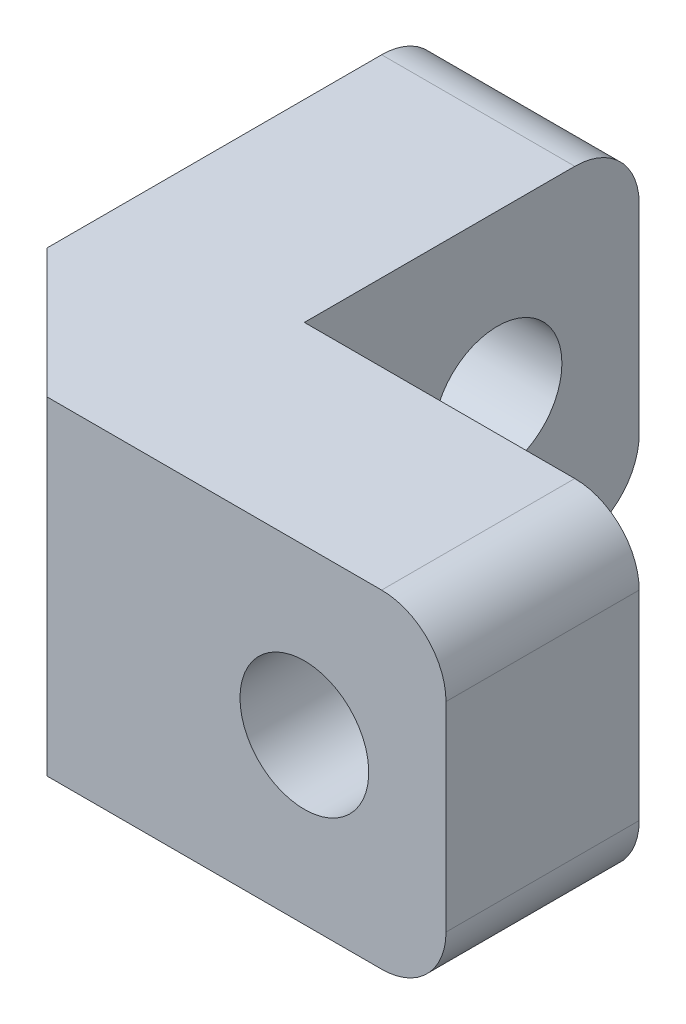
ISO-10303-21;
HEADER;
FILE_DESCRIPTION(('STEP AP214'),'2;1');
FILE_NAME('part.step','',(''),(''),'','','');
FILE_SCHEMA(('AUTOMOTIVE_DESIGN { 1 0 10303 214 1 1 1 1 }'));
ENDSEC;
DATA;
#1=APPLICATION_CONTEXT('core data for automotive mechanical design processes');
#2=APPLICATION_PROTOCOL_DEFINITION('international standard','automotive_design',2000,#1);
#3=PRODUCT_CONTEXT('',#1,'mechanical');
#4=PRODUCT('Part','Part','',(#3));
#5=PRODUCT_RELATED_PRODUCT_CATEGORY('part','',(#4));
#6=PRODUCT_DEFINITION_FORMATION('','',#4);
#7=PRODUCT_DEFINITION_CONTEXT('part definition',#1,'design');
#8=PRODUCT_DEFINITION('design','',#6,#7);
#9=PRODUCT_DEFINITION_SHAPE('','',#8);
#10=(LENGTH_UNIT() NAMED_UNIT(*) SI_UNIT(.MILLI.,.METRE.));
#11=(NAMED_UNIT(*) PLANE_ANGLE_UNIT() SI_UNIT($,.RADIAN.));
#12=(NAMED_UNIT(*) SI_UNIT($,.STERADIAN.) SOLID_ANGLE_UNIT());
#13=UNCERTAINTY_MEASURE_WITH_UNIT(LENGTH_MEASURE(1.E-05),#10,'distance_accuracy_value','');
#14=(GEOMETRIC_REPRESENTATION_CONTEXT(3) GLOBAL_UNCERTAINTY_ASSIGNED_CONTEXT((#13)) GLOBAL_UNIT_ASSIGNED_CONTEXT((#10,
#11,#12)) REPRESENTATION_CONTEXT('',''));
#15=CARTESIAN_POINT('',(0.,0.,0.));
#16=DIRECTION('',(0.,0.,1.));
#17=DIRECTION('',(1.,0.,0.));
#18=AXIS2_PLACEMENT_3D('',#15,#16,#17);
#19=CARTESIAN_POINT('',(-5.1,2.55,-3.));
#20=DIRECTION('',(1.,0.,0.));
#21=DIRECTION('',(0.,0.,-1.));
#22=AXIS2_PLACEMENT_3D('',#19,#20,#21);
#23=CYLINDRICAL_SURFACE('',#22,1.);
#24=CARTESIAN_POINT('',(0.,2.55,-3.));
#25=DIRECTION('',(1.,0.,0.));
#26=DIRECTION('',(0.,0.,-1.));
#27=AXIS2_PLACEMENT_3D('',#24,#25,#26);
#28=CIRCLE('',#27,1.);
#29=CARTESIAN_POINT('',(0.,2.55,-4.));
#30=VERTEX_POINT('',#29);
#31=EDGE_CURVE('E195',#30,#30,#28,.T.);
#32=ORIENTED_EDGE('',*,*,#31,.T.);
#33=EDGE_LOOP('',(#32));
#34=FACE_BOUND('',#33,.T.);
#35=CARTESIAN_POINT('',(-1.6,2.55,-3.));
#36=DIRECTION('',(-1.,0.,0.));
#37=DIRECTION('',(0.,0.,1.));
#38=AXIS2_PLACEMENT_3D('',#35,#36,#37);
#39=CIRCLE('',#38,1.);
#40=CARTESIAN_POINT('',(-1.6,2.55,-2.));
#41=VERTEX_POINT('',#40);
#42=EDGE_CURVE('E41',#41,#41,#39,.F.);
#43=ORIENTED_EDGE('',*,*,#42,.F.);
#44=EDGE_LOOP('',(#43));
#45=FACE_BOUND('',#44,.T.);
#46=ADVANCED_FACE('F37',(#34,#45),#23,.F.);
#47=CARTESIAN_POINT('',(3.,2.55,5.1));
#48=DIRECTION('',(0.,0.,-1.));
#49=DIRECTION('',(-1.,0.,0.));
#50=AXIS2_PLACEMENT_3D('',#47,#48,#49);
#51=CYLINDRICAL_SURFACE('',#50,1.);
#52=CARTESIAN_POINT('',(3.,2.55,3.));
#53=DIRECTION('',(0.,0.,-1.));
#54=DIRECTION('',(-1.,0.,0.));
#55=AXIS2_PLACEMENT_3D('',#52,#53,#54);
#56=CIRCLE('',#55,1.);
#57=CARTESIAN_POINT('',(2.,2.55,3.));
#58=VERTEX_POINT('',#57);
#59=EDGE_CURVE('E193',#58,#58,#56,.T.);
#60=ORIENTED_EDGE('',*,*,#59,.F.);
#61=EDGE_LOOP('',(#60));
#62=FACE_BOUND('',#61,.T.);
#63=CARTESIAN_POINT('',(3.,2.55,1.4));
#64=DIRECTION('',(0.,0.,-1.));
#65=DIRECTION('',(-1.,0.,0.));
#66=AXIS2_PLACEMENT_3D('',#63,#64,#65);
#67=CIRCLE('',#66,1.);
#68=CARTESIAN_POINT('',(2.,2.55,1.4));
#69=VERTEX_POINT('',#68);
#70=EDGE_CURVE('E196',#69,#69,#67,.F.);
#71=ORIENTED_EDGE('',*,*,#70,.F.);
#72=EDGE_LOOP('',(#71));
#73=FACE_BOUND('',#72,.T.);
#74=ADVANCED_FACE('F271',(#62,#73),#51,.F.);
#75=CARTESIAN_POINT('',(0.,5.1,0.));
#76=DIRECTION('',(0.,0.,1.));
#77=DIRECTION('',(1.,0.,0.));
#78=AXIS2_PLACEMENT_3D('',#75,#76,#77);
#79=PLANE('',#78);
#80=CARTESIAN_POINT('',(3.,2.55,0.));
#81=DIRECTION('',(0.,0.,-1.));
#82=DIRECTION('',(-1.,0.,0.));
#83=AXIS2_PLACEMENT_3D('',#80,#81,#82);
#84=CIRCLE('',#83,1.7);
#85=CARTESIAN_POINT('',(1.3,2.55,0.));
#86=VERTEX_POINT('',#85);
#87=EDGE_CURVE('E202',#86,#86,#84,.T.);
#88=ORIENTED_EDGE('',*,*,#87,.F.);
#89=EDGE_LOOP('',(#88));
#90=FACE_BOUND('',#89,.T.);
#91=DIRECTION('',(0.,-1.,0.));
#92=VECTOR('',#91,1.);
#93=CARTESIAN_POINT('',(5.2,5.1,0.));
#94=LINE('',#93,#92);
#95=CARTESIAN_POINT('',(5.2,4.1,0.));
#96=VERTEX_POINT('',#95);
#97=CARTESIAN_POINT('',(5.2,1.,0.));
#98=VERTEX_POINT('',#97);
#99=EDGE_CURVE('E217',#96,#98,#94,.T.);
#100=ORIENTED_EDGE('',*,*,#99,.T.);
#101=CARTESIAN_POINT('',(4.2,1.,0.));
#102=DIRECTION('',(0.,0.,1.));
#103=DIRECTION('',(1.,0.,0.));
#104=AXIS2_PLACEMENT_3D('',#101,#102,#103);
#105=CIRCLE('',#104,1.);
#106=CARTESIAN_POINT('',(4.2,0.,0.));
#107=VERTEX_POINT('',#106);
#108=EDGE_CURVE('E171',#98,#107,#105,.F.);
#109=ORIENTED_EDGE('',*,*,#108,.T.);
#110=DIRECTION('',(-1.,0.,0.));
#111=VECTOR('',#110,1.);
#112=CARTESIAN_POINT('',(0.,0.,0.));
#113=LINE('',#112,#111);
#114=CARTESIAN_POINT('',(0.,0.,0.));
#115=VERTEX_POINT('',#114);
#116=EDGE_CURVE('E145',#107,#115,#113,.T.);
#117=ORIENTED_EDGE('',*,*,#116,.T.);
#118=DIRECTION('',(0.,-1.,0.));
#119=VECTOR('',#118,1.);
#120=CARTESIAN_POINT('',(0.,5.1,0.));
#121=LINE('',#120,#119);
#122=CARTESIAN_POINT('',(0.,5.1,0.));
#123=VERTEX_POINT('',#122);
#124=EDGE_CURVE('E138',#123,#115,#121,.T.);
#125=ORIENTED_EDGE('',*,*,#124,.F.);
#126=DIRECTION('',(-1.,0.,0.));
#127=VECTOR('',#126,1.);
#128=CARTESIAN_POINT('',(0.,5.1,0.));
#129=LINE('',#128,#127);
#130=CARTESIAN_POINT('',(4.2,5.1,0.));
#131=VERTEX_POINT('',#130);
#132=EDGE_CURVE('E123',#131,#123,#129,.T.);
#133=ORIENTED_EDGE('',*,*,#132,.F.);
#134=CARTESIAN_POINT('',(4.2,4.1,0.));
#135=DIRECTION('',(0.,0.,1.));
#136=DIRECTION('',(1.,0.,0.));
#137=AXIS2_PLACEMENT_3D('',#134,#135,#136);
#138=CIRCLE('',#137,1.);
#139=EDGE_CURVE('E169',#131,#96,#138,.F.);
#140=ORIENTED_EDGE('',*,*,#139,.T.);
#141=EDGE_LOOP('',(#100,#109,#117,#125,#133,#140));
#142=FACE_BOUND('',#141,.T.);
#143=ADVANCED_FACE('F143',(#90,#142),#79,.F.);
#144=CARTESIAN_POINT('',(0.,5.1,0.));
#145=DIRECTION('',(-1.,0.,0.));
#146=DIRECTION('',(0.,0.,1.));
#147=AXIS2_PLACEMENT_3D('',#144,#145,#146);
#148=PLANE('',#147);
#149=ORIENTED_EDGE('',*,*,#31,.F.);
#150=EDGE_LOOP('',(#149));
#151=FACE_BOUND('',#150,.T.);
#152=DIRECTION('',(0.,0.,-1.));
#153=VECTOR('',#152,1.);
#154=CARTESIAN_POINT('',(0.,0.,0.));
#155=LINE('',#154,#153);
#156=CARTESIAN_POINT('',(0.,0.,-4.2));
#157=VERTEX_POINT('',#156);
#158=EDGE_CURVE('E219',#115,#157,#155,.T.);
#159=ORIENTED_EDGE('',*,*,#158,.T.);
#160=CARTESIAN_POINT('',(0.,1.,-4.2));
#161=DIRECTION('',(-1.,0.,0.));
#162=DIRECTION('',(0.,0.,1.));
#163=AXIS2_PLACEMENT_3D('',#160,#161,#162);
#164=CIRCLE('',#163,1.);
#165=CARTESIAN_POINT('',(0.,1.,-5.2));
#166=VERTEX_POINT('',#165);
#167=EDGE_CURVE('E11',#157,#166,#164,.F.);
#168=ORIENTED_EDGE('',*,*,#167,.T.);
#169=DIRECTION('',(0.,-1.,0.));
#170=VECTOR('',#169,1.);
#171=CARTESIAN_POINT('',(0.,5.1,-5.2));
#172=LINE('',#171,#170);
#173=CARTESIAN_POINT('',(0.,4.1,-5.2));
#174=VERTEX_POINT('',#173);
#175=EDGE_CURVE('E148',#174,#166,#172,.T.);
#176=ORIENTED_EDGE('',*,*,#175,.F.);
#177=CARTESIAN_POINT('',(0.,4.1,-4.2));
#178=DIRECTION('',(-1.,0.,0.));
#179=DIRECTION('',(0.,0.,1.));
#180=AXIS2_PLACEMENT_3D('',#177,#178,#179);
#181=CIRCLE('',#180,1.);
#182=CARTESIAN_POINT('',(0.,5.1,-4.2));
#183=VERTEX_POINT('',#182);
#184=EDGE_CURVE('E46',#174,#183,#181,.F.);
#185=ORIENTED_EDGE('',*,*,#184,.T.);
#186=DIRECTION('',(0.,0.,-1.));
#187=VECTOR('',#186,1.);
#188=CARTESIAN_POINT('',(0.,5.1,0.));
#189=LINE('',#188,#187);
#190=EDGE_CURVE('E128',#123,#183,#189,.T.);
#191=ORIENTED_EDGE('',*,*,#190,.F.);
#192=ORIENTED_EDGE('',*,*,#124,.T.);
#193=EDGE_LOOP('',(#159,#168,#176,#185,#191,#192));
#194=FACE_BOUND('',#193,.T.);
#195=ADVANCED_FACE('F137',(#151,#194),#148,.F.);
#196=CARTESIAN_POINT('',(0.,5.1,-5.2));
#197=DIRECTION('',(0.,0.,1.));
#198=DIRECTION('',(1.,0.,0.));
#199=AXIS2_PLACEMENT_3D('',#196,#197,#198);
#200=PLANE('',#199);
#201=ORIENTED_EDGE('',*,*,#175,.T.);
#202=DIRECTION('',(-1.,0.,0.));
#203=VECTOR('',#202,1.);
#204=CARTESIAN_POINT('',(0.,1.,-5.2));
#205=LINE('',#204,#203);
#206=CARTESIAN_POINT('',(-3.,1.,-5.2));
#207=VERTEX_POINT('',#206);
#208=EDGE_CURVE('E185',#166,#207,#205,.T.);
#209=ORIENTED_EDGE('',*,*,#208,.T.);
#210=DIRECTION('',(0.,-1.,0.));
#211=VECTOR('',#210,1.);
#212=CARTESIAN_POINT('',(-3.,5.1,-5.2));
#213=LINE('',#212,#211);
#214=CARTESIAN_POINT('',(-3.,4.1,-5.2));
#215=VERTEX_POINT('',#214);
#216=EDGE_CURVE('E153',#215,#207,#213,.T.);
#217=ORIENTED_EDGE('',*,*,#216,.F.);
#218=DIRECTION('',(-1.,0.,0.));
#219=VECTOR('',#218,1.);
#220=CARTESIAN_POINT('',(0.,4.1,-5.2));
#221=LINE('',#220,#219);
#222=EDGE_CURVE('E59',#215,#174,#221,.F.);
#223=ORIENTED_EDGE('',*,*,#222,.T.);
#224=EDGE_LOOP('',(#201,#209,#217,#223));
#225=FACE_BOUND('',#224,.T.);
#226=ADVANCED_FACE('F233',(#225),#200,.F.);
#227=CARTESIAN_POINT('',(-3.,5.1,-5.2));
#228=DIRECTION('',(1.,0.,0.));
#229=DIRECTION('',(0.,0.,-1.));
#230=AXIS2_PLACEMENT_3D('',#227,#228,#229);
#231=PLANE('',#230);
#232=CARTESIAN_POINT('',(-3.,2.55,-3.));
#233=DIRECTION('',(-1.,0.,0.));
#234=DIRECTION('',(0.,0.,1.));
#235=AXIS2_PLACEMENT_3D('',#232,#233,#234);
#236=CIRCLE('',#235,1.7);
#237=CARTESIAN_POINT('',(-3.,2.55,-1.3));
#238=VERTEX_POINT('',#237);
#239=EDGE_CURVE('E209',#238,#238,#236,.T.);
#240=ORIENTED_EDGE('',*,*,#239,.F.);
#241=EDGE_LOOP('',(#240));
#242=FACE_BOUND('',#241,.T.);
#243=ORIENTED_EDGE('',*,*,#216,.T.);
#244=CARTESIAN_POINT('',(-3.,1.,-4.2));
#245=DIRECTION('',(1.,0.,0.));
#246=DIRECTION('',(0.,0.,-1.));
#247=AXIS2_PLACEMENT_3D('',#244,#245,#246);
#248=CIRCLE('',#247,1.);
#249=CARTESIAN_POINT('',(-3.,0.,-4.2));
#250=VERTEX_POINT('',#249);
#251=EDGE_CURVE('E190',#207,#250,#248,.F.);
#252=ORIENTED_EDGE('',*,*,#251,.T.);
#253=DIRECTION('',(0.,0.,1.));
#254=VECTOR('',#253,1.);
#255=CARTESIAN_POINT('',(-3.,0.,-5.2));
#256=LINE('',#255,#254);
#257=CARTESIAN_POINT('',(-3.,0.,0.999999999999991));
#258=VERTEX_POINT('',#257);
#259=EDGE_CURVE('E221',#250,#258,#256,.T.);
#260=ORIENTED_EDGE('',*,*,#259,.T.);
#261=DIRECTION('',(0.,1.,0.));
#262=VECTOR('',#261,1.);
#263=CARTESIAN_POINT('',(-3.,5.1,0.999999999999991));
#264=LINE('',#263,#262);
#265=CARTESIAN_POINT('',(-3.,5.1,0.99999999999999));
#266=VERTEX_POINT('',#265);
#267=EDGE_CURVE('E159',#258,#266,#264,.T.);
#268=ORIENTED_EDGE('',*,*,#267,.T.);
#269=DIRECTION('',(0.,0.,1.));
#270=VECTOR('',#269,1.);
#271=CARTESIAN_POINT('',(-3.,5.1,-5.2));
#272=LINE('',#271,#270);
#273=CARTESIAN_POINT('',(-3.,5.1,-4.2));
#274=VERTEX_POINT('',#273);
#275=EDGE_CURVE('E140',#274,#266,#272,.T.);
#276=ORIENTED_EDGE('',*,*,#275,.F.);
#277=CARTESIAN_POINT('',(-3.,4.1,-4.2));
#278=DIRECTION('',(1.,0.,0.));
#279=DIRECTION('',(0.,0.,-1.));
#280=AXIS2_PLACEMENT_3D('',#277,#278,#279);
#281=CIRCLE('',#280,1.);
#282=EDGE_CURVE('E188',#274,#215,#281,.F.);
#283=ORIENTED_EDGE('',*,*,#282,.T.);
#284=EDGE_LOOP('',(#243,#252,#260,#268,#276,#283));
#285=FACE_BOUND('',#284,.T.);
#286=ADVANCED_FACE('F230',(#242,#285),#231,.F.);
#287=CARTESIAN_POINT('',(-3.,5.1,3.));
#288=DIRECTION('',(0.,0.,-1.));
#289=DIRECTION('',(-1.,0.,0.));
#290=AXIS2_PLACEMENT_3D('',#287,#288,#289);
#291=PLANE('',#290);
#292=ORIENTED_EDGE('',*,*,#59,.T.);
#293=EDGE_LOOP('',(#292));
#294=FACE_BOUND('',#293,.T.);
#295=DIRECTION('',(1.,0.,0.));
#296=VECTOR('',#295,1.);
#297=CARTESIAN_POINT('',(-3.,0.,3.));
#298=LINE('',#297,#296);
#299=CARTESIAN_POINT('',(-0.999999999999998,0.,3.));
#300=VERTEX_POINT('',#299);
#301=CARTESIAN_POINT('',(4.2,0.,3.));
#302=VERTEX_POINT('',#301);
#303=EDGE_CURVE('E134',#300,#302,#298,.T.);
#304=ORIENTED_EDGE('',*,*,#303,.T.);
#305=CARTESIAN_POINT('',(4.2,1.,3.));
#306=DIRECTION('',(0.,0.,-1.));
#307=DIRECTION('',(-1.,0.,0.));
#308=AXIS2_PLACEMENT_3D('',#305,#306,#307);
#309=CIRCLE('',#308,1.);
#310=CARTESIAN_POINT('',(5.2,1.,3.));
#311=VERTEX_POINT('',#310);
#312=EDGE_CURVE('E179',#302,#311,#309,.F.);
#313=ORIENTED_EDGE('',*,*,#312,.T.);
#314=DIRECTION('',(0.,-1.,0.));
#315=VECTOR('',#314,1.);
#316=CARTESIAN_POINT('',(5.2,5.1,3.));
#317=LINE('',#316,#315);
#318=CARTESIAN_POINT('',(5.2,4.1,3.));
#319=VERTEX_POINT('',#318);
#320=EDGE_CURVE('E226',#319,#311,#317,.T.);
#321=ORIENTED_EDGE('',*,*,#320,.F.);
#322=CARTESIAN_POINT('',(4.2,4.1,3.));
#323=DIRECTION('',(0.,0.,-1.));
#324=DIRECTION('',(-1.,0.,0.));
#325=AXIS2_PLACEMENT_3D('',#322,#323,#324);
#326=CIRCLE('',#325,1.);
#327=CARTESIAN_POINT('',(4.2,5.1,3.));
#328=VERTEX_POINT('',#327);
#329=EDGE_CURVE('E177',#319,#328,#326,.F.);
#330=ORIENTED_EDGE('',*,*,#329,.T.);
#331=DIRECTION('',(1.,0.,0.));
#332=VECTOR('',#331,1.);
#333=CARTESIAN_POINT('',(-3.,5.1,3.));
#334=LINE('',#333,#332);
#335=CARTESIAN_POINT('',(-0.999999999999998,5.1,3.));
#336=VERTEX_POINT('',#335);
#337=EDGE_CURVE('E215',#336,#328,#334,.T.);
#338=ORIENTED_EDGE('',*,*,#337,.F.);
#339=DIRECTION('',(0.,-1.,0.));
#340=VECTOR('',#339,1.);
#341=CARTESIAN_POINT('',(-0.999999999999998,5.1,3.));
#342=LINE('',#341,#340);
#343=EDGE_CURVE('E147',#336,#300,#342,.T.);
#344=ORIENTED_EDGE('',*,*,#343,.T.);
#345=EDGE_LOOP('',(#304,#313,#321,#330,#338,#344));
#346=FACE_BOUND('',#345,.T.);
#347=ADVANCED_FACE('F243',(#294,#346),#291,.F.);
#348=CARTESIAN_POINT('',(5.2,5.1,3.));
#349=DIRECTION('',(-1.,0.,0.));
#350=DIRECTION('',(0.,0.,1.));
#351=AXIS2_PLACEMENT_3D('',#348,#349,#350);
#352=PLANE('',#351);
#353=ORIENTED_EDGE('',*,*,#320,.T.);
#354=DIRECTION('',(0.,0.,-1.));
#355=VECTOR('',#354,1.);
#356=CARTESIAN_POINT('',(5.2,1.,3.));
#357=LINE('',#356,#355);
#358=EDGE_CURVE('E166',#311,#98,#357,.T.);
#359=ORIENTED_EDGE('',*,*,#358,.T.);
#360=ORIENTED_EDGE('',*,*,#99,.F.);
#361=DIRECTION('',(0.,0.,-1.));
#362=VECTOR('',#361,1.);
#363=CARTESIAN_POINT('',(5.2,4.1,3.));
#364=LINE('',#363,#362);
#365=EDGE_CURVE('E164',#96,#319,#364,.F.);
#366=ORIENTED_EDGE('',*,*,#365,.T.);
#367=EDGE_LOOP('',(#353,#359,#360,#366));
#368=FACE_BOUND('',#367,.T.);
#369=ADVANCED_FACE('F252',(#368),#352,.F.);
#370=CARTESIAN_POINT('',(0.,5.1,0.));
#371=DIRECTION('',(0.,1.,0.));
#372=DIRECTION('',(0.,0.,1.));
#373=AXIS2_PLACEMENT_3D('',#370,#371,#372);
#374=PLANE('',#373);
#375=ORIENTED_EDGE('',*,*,#337,.T.);
#376=DIRECTION('',(0.,0.,-1.));
#377=VECTOR('',#376,1.);
#378=CARTESIAN_POINT('',(4.2,5.1,0.));
#379=LINE('',#378,#377);
#380=EDGE_CURVE('E131',#328,#131,#379,.T.);
#381=ORIENTED_EDGE('',*,*,#380,.T.);
#382=ORIENTED_EDGE('',*,*,#132,.T.);
#383=ORIENTED_EDGE('',*,*,#190,.T.);
#384=DIRECTION('',(-1.,0.,0.));
#385=VECTOR('',#384,1.);
#386=CARTESIAN_POINT('',(-3.,5.1,-4.2));
#387=LINE('',#386,#385);
#388=EDGE_CURVE('E181',#183,#274,#387,.T.);
#389=ORIENTED_EDGE('',*,*,#388,.T.);
#390=ORIENTED_EDGE('',*,*,#275,.T.);
#391=DIRECTION('',(-0.707106781186546,0.,-0.707106781186549));
#392=VECTOR('',#391,1.);
#393=CARTESIAN_POINT('',(-2.,5.1,1.99999999999999));
#394=LINE('',#393,#392);
#395=EDGE_CURVE('E162',#266,#336,#394,.F.);
#396=ORIENTED_EDGE('',*,*,#395,.T.);
#397=EDGE_LOOP('',(#375,#381,#382,#383,#389,#390,#396));
#398=FACE_BOUND('',#397,.T.);
#399=ADVANCED_FACE('F126',(#398),#374,.T.);
#400=CARTESIAN_POINT('',(0.,0.,0.));
#401=DIRECTION('',(0.,1.,0.));
#402=DIRECTION('',(0.,0.,1.));
#403=AXIS2_PLACEMENT_3D('',#400,#401,#402);
#404=PLANE('',#403);
#405=ORIENTED_EDGE('',*,*,#116,.F.);
#406=DIRECTION('',(0.,0.,-1.));
#407=VECTOR('',#406,1.);
#408=CARTESIAN_POINT('',(4.2,0.,0.));
#409=LINE('',#408,#407);
#410=EDGE_CURVE('E175',#107,#302,#409,.F.);
#411=ORIENTED_EDGE('',*,*,#410,.T.);
#412=ORIENTED_EDGE('',*,*,#303,.F.);
#413=DIRECTION('',(0.707106781186546,0.,0.707106781186549));
#414=VECTOR('',#413,1.);
#415=CARTESIAN_POINT('',(-0.999999999999998,0.,3.));
#416=LINE('',#415,#414);
#417=EDGE_CURVE('E151',#300,#258,#416,.F.);
#418=ORIENTED_EDGE('',*,*,#417,.T.);
#419=ORIENTED_EDGE('',*,*,#259,.F.);
#420=DIRECTION('',(-1.,0.,0.));
#421=VECTOR('',#420,1.);
#422=CARTESIAN_POINT('',(0.,0.,-4.2));
#423=LINE('',#422,#421);
#424=EDGE_CURVE('E173',#250,#157,#423,.F.);
#425=ORIENTED_EDGE('',*,*,#424,.T.);
#426=ORIENTED_EDGE('',*,*,#158,.F.);
#427=EDGE_LOOP('',(#405,#411,#412,#418,#419,#425,#426));
#428=FACE_BOUND('',#427,.T.);
#429=ADVANCED_FACE('F259',(#428),#404,.F.);
#430=CARTESIAN_POINT('',(-0.999999999999998,5.1,3.));
#431=DIRECTION('',(0.707106781186549,0.,-0.707106781186546));
#432=DIRECTION('',(0.,-1.,0.));
#433=AXIS2_PLACEMENT_3D('',#430,#431,#432);
#434=PLANE('',#433);
#435=ORIENTED_EDGE('',*,*,#395,.F.);
#436=ORIENTED_EDGE('',*,*,#267,.F.);
#437=ORIENTED_EDGE('',*,*,#417,.F.);
#438=ORIENTED_EDGE('',*,*,#343,.F.);
#439=EDGE_LOOP('',(#435,#436,#437,#438));
#440=FACE_BOUND('',#439,.T.);
#441=ADVANCED_FACE('F240',(#440),#434,.F.);
#442=CARTESIAN_POINT('',(4.2,1.,3.));
#443=DIRECTION('',(0.,0.,-1.));
#444=DIRECTION('',(-1.,0.,0.));
#445=AXIS2_PLACEMENT_3D('',#442,#443,#444);
#446=CYLINDRICAL_SURFACE('',#445,1.);
#447=ORIENTED_EDGE('',*,*,#312,.F.);
#448=ORIENTED_EDGE('',*,*,#410,.F.);
#449=ORIENTED_EDGE('',*,*,#108,.F.);
#450=ORIENTED_EDGE('',*,*,#358,.F.);
#451=EDGE_LOOP('',(#447,#448,#449,#450));
#452=FACE_BOUND('',#451,.T.);
#453=ADVANCED_FACE('F256',(#452),#446,.T.);
#454=CARTESIAN_POINT('',(4.2,4.1,0.));
#455=DIRECTION('',(0.,0.,1.));
#456=DIRECTION('',(1.,0.,0.));
#457=AXIS2_PLACEMENT_3D('',#454,#455,#456);
#458=CYLINDRICAL_SURFACE('',#457,1.);
#459=ORIENTED_EDGE('',*,*,#329,.F.);
#460=ORIENTED_EDGE('',*,*,#365,.F.);
#461=ORIENTED_EDGE('',*,*,#139,.F.);
#462=ORIENTED_EDGE('',*,*,#380,.F.);
#463=EDGE_LOOP('',(#459,#460,#461,#462));
#464=FACE_BOUND('',#463,.T.);
#465=ADVANCED_FACE('F249',(#464),#458,.T.);
#466=CARTESIAN_POINT('',(0.,1.,-4.2));
#467=DIRECTION('',(-1.,0.,0.));
#468=DIRECTION('',(0.,0.,1.));
#469=AXIS2_PLACEMENT_3D('',#466,#467,#468);
#470=CYLINDRICAL_SURFACE('',#469,1.);
#471=ORIENTED_EDGE('',*,*,#167,.F.);
#472=ORIENTED_EDGE('',*,*,#424,.F.);
#473=ORIENTED_EDGE('',*,*,#251,.F.);
#474=ORIENTED_EDGE('',*,*,#208,.F.);
#475=EDGE_LOOP('',(#471,#472,#473,#474));
#476=FACE_BOUND('',#475,.T.);
#477=ADVANCED_FACE('F262',(#476),#470,.T.);
#478=CARTESIAN_POINT('',(0.,4.1,-4.2));
#479=DIRECTION('',(1.,0.,0.));
#480=DIRECTION('',(0.,0.,-1.));
#481=AXIS2_PLACEMENT_3D('',#478,#479,#480);
#482=CYLINDRICAL_SURFACE('',#481,1.);
#483=ORIENTED_EDGE('',*,*,#184,.F.);
#484=ORIENTED_EDGE('',*,*,#222,.F.);
#485=ORIENTED_EDGE('',*,*,#282,.F.);
#486=ORIENTED_EDGE('',*,*,#388,.F.);
#487=EDGE_LOOP('',(#483,#484,#485,#486));
#488=FACE_BOUND('',#487,.T.);
#489=ADVANCED_FACE('F39',(#488),#482,.T.);
#490=CARTESIAN_POINT('',(3.,2.55,1.4));
#491=DIRECTION('',(0.,0.,-1.));
#492=DIRECTION('',(-1.,0.,0.));
#493=AXIS2_PLACEMENT_3D('',#490,#491,#492);
#494=PLANE('',#493);
#495=CARTESIAN_POINT('',(3.,2.55,1.4));
#496=DIRECTION('',(0.,0.,-1.));
#497=DIRECTION('',(-1.,0.,0.));
#498=AXIS2_PLACEMENT_3D('',#495,#496,#497);
#499=CIRCLE('',#498,1.7);
#500=CARTESIAN_POINT('',(1.3,2.55,1.4));
#501=VERTEX_POINT('',#500);
#502=EDGE_CURVE('E198',#501,#501,#499,.T.);
#503=ORIENTED_EDGE('',*,*,#502,.T.);
#504=EDGE_LOOP('',(#503));
#505=FACE_BOUND('',#504,.T.);
#506=ORIENTED_EDGE('',*,*,#70,.T.);
#507=EDGE_LOOP('',(#506));
#508=FACE_BOUND('',#507,.T.);
#509=ADVANCED_FACE('F268',(#505,#508),#494,.T.);
#510=CARTESIAN_POINT('',(3.,2.55,1.4));
#511=DIRECTION('',(0.,0.,-1.));
#512=DIRECTION('',(-1.,0.,0.));
#513=AXIS2_PLACEMENT_3D('',#510,#511,#512);
#514=CYLINDRICAL_SURFACE('',#513,1.7);
#515=ORIENTED_EDGE('',*,*,#502,.F.);
#516=EDGE_LOOP('',(#515));
#517=FACE_BOUND('',#516,.T.);
#518=ORIENTED_EDGE('',*,*,#87,.T.);
#519=EDGE_LOOP('',(#518));
#520=FACE_BOUND('',#519,.T.);
#521=ADVANCED_FACE('F360',(#517,#520),#514,.F.);
#522=CARTESIAN_POINT('',(-1.6,2.55,-3.));
#523=DIRECTION('',(-1.,0.,0.));
#524=DIRECTION('',(0.,0.,1.));
#525=AXIS2_PLACEMENT_3D('',#522,#523,#524);
#526=PLANE('',#525);
#527=CARTESIAN_POINT('',(-1.6,2.55,-3.));
#528=DIRECTION('',(-1.,0.,0.));
#529=DIRECTION('',(0.,0.,1.));
#530=AXIS2_PLACEMENT_3D('',#527,#528,#529);
#531=CIRCLE('',#530,1.7);
#532=CARTESIAN_POINT('',(-1.6,2.55,-1.3));
#533=VERTEX_POINT('',#532);
#534=EDGE_CURVE('E404',#533,#533,#531,.T.);
#535=ORIENTED_EDGE('',*,*,#534,.T.);
#536=EDGE_LOOP('',(#535));
#537=FACE_BOUND('',#536,.T.);
#538=ORIENTED_EDGE('',*,*,#42,.T.);
#539=EDGE_LOOP('',(#538));
#540=FACE_BOUND('',#539,.T.);
#541=ADVANCED_FACE('F368',(#537,#540),#526,.T.);
#542=CARTESIAN_POINT('',(-1.6,2.55,-3.));
#543=DIRECTION('',(-1.,0.,0.));
#544=DIRECTION('',(0.,0.,1.));
#545=AXIS2_PLACEMENT_3D('',#542,#543,#544);
#546=CYLINDRICAL_SURFACE('',#545,1.7);
#547=ORIENTED_EDGE('',*,*,#534,.F.);
#548=EDGE_LOOP('',(#547));
#549=FACE_BOUND('',#548,.T.);
#550=ORIENTED_EDGE('',*,*,#239,.T.);
#551=EDGE_LOOP('',(#550));
#552=FACE_BOUND('',#551,.T.);
#553=ADVANCED_FACE('F387',(#549,#552),#546,.F.);
#554=CLOSED_SHELL('',(#46,#74,#143,#195,#226,#286,#347,#369,#399,#429,#441,#453,#465,#477,#489,
#509,#521,#541,#553));
#555=MANIFOLD_SOLID_BREP('B2',#554);
#556=ADVANCED_BREP_SHAPE_REPRESENTATION('',(#18,#555),#14);
#557=SHAPE_DEFINITION_REPRESENTATION(#9,#556);
ENDSEC;
END-ISO-10303-21;
